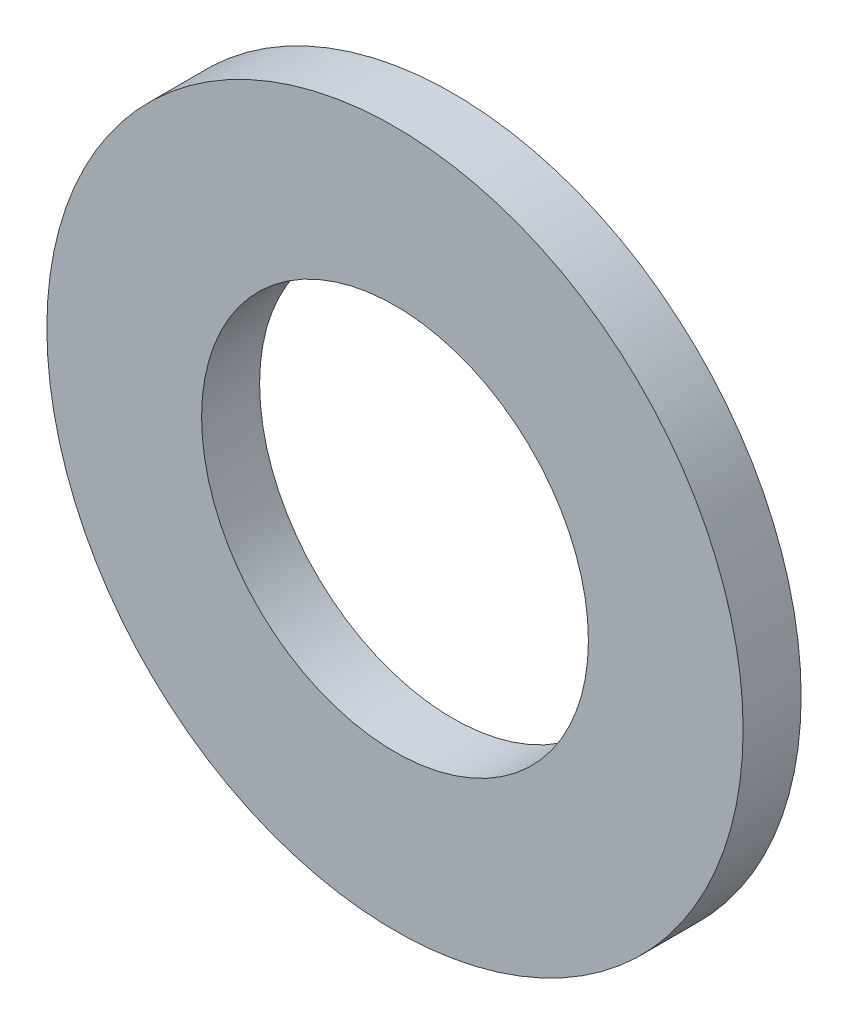
ISO-10303-21;
HEADER;
FILE_DESCRIPTION(('STEP AP214'),'2;1');
FILE_NAME('part.step','',(''),(''),'','','');
FILE_SCHEMA(('AUTOMOTIVE_DESIGN { 1 0 10303 214 1 1 1 1 }'));
ENDSEC;
DATA;
#1=APPLICATION_CONTEXT('core data for automotive mechanical design processes');
#2=APPLICATION_PROTOCOL_DEFINITION('international standard','automotive_design',2000,#1);
#3=PRODUCT_CONTEXT('',#1,'mechanical');
#4=PRODUCT('Part','Part','',(#3));
#5=PRODUCT_RELATED_PRODUCT_CATEGORY('part','',(#4));
#6=PRODUCT_DEFINITION_FORMATION('','',#4);
#7=PRODUCT_DEFINITION_CONTEXT('part definition',#1,'design');
#8=PRODUCT_DEFINITION('design','',#6,#7);
#9=PRODUCT_DEFINITION_SHAPE('','',#8);
#10=(LENGTH_UNIT() NAMED_UNIT(*) SI_UNIT(.MILLI.,.METRE.));
#11=(NAMED_UNIT(*) PLANE_ANGLE_UNIT() SI_UNIT($,.RADIAN.));
#12=(NAMED_UNIT(*) SI_UNIT($,.STERADIAN.) SOLID_ANGLE_UNIT());
#13=UNCERTAINTY_MEASURE_WITH_UNIT(LENGTH_MEASURE(1.E-05),#10,'distance_accuracy_value','');
#14=(GEOMETRIC_REPRESENTATION_CONTEXT(3) GLOBAL_UNCERTAINTY_ASSIGNED_CONTEXT((#13)) GLOBAL_UNIT_ASSIGNED_CONTEXT((#10,
#11,#12)) REPRESENTATION_CONTEXT('',''));
#15=CARTESIAN_POINT('',(0.,0.,0.));
#16=DIRECTION('',(0.,0.,1.));
#17=DIRECTION('',(1.,0.,0.));
#18=AXIS2_PLACEMENT_3D('',#15,#16,#17);
#19=CARTESIAN_POINT('',(0.,0.,0.749999999999999));
#20=DIRECTION('',(0.,0.,-1.));
#21=DIRECTION('',(1.,0.,0.));
#22=AXIS2_PLACEMENT_3D('',#19,#20,#21);
#23=CYLINDRICAL_SURFACE('',#22,9.);
#24=CARTESIAN_POINT('',(0.,0.,0.749999999999999));
#25=DIRECTION('',(0.,0.,1.));
#26=DIRECTION('',(1.,0.,0.));
#27=AXIS2_PLACEMENT_3D('',#24,#25,#26);
#28=CIRCLE('',#27,9.);
#29=CARTESIAN_POINT('',(9.,0.,0.749999999999999));
#30=VERTEX_POINT('',#29);
#31=EDGE_CURVE('E10',#30,#30,#28,.T.);
#32=ORIENTED_EDGE('',*,*,#31,.F.);
#33=EDGE_LOOP('',(#32));
#34=FACE_BOUND('',#33,.T.);
#35=CARTESIAN_POINT('',(0.,0.,-0.749999999999999));
#36=DIRECTION('',(0.,0.,1.));
#37=DIRECTION('',(1.,0.,0.));
#38=AXIS2_PLACEMENT_3D('',#35,#36,#37);
#39=CIRCLE('',#38,9.);
#40=CARTESIAN_POINT('',(9.,0.,-0.749999999999999));
#41=VERTEX_POINT('',#40);
#42=EDGE_CURVE('E49',#41,#41,#39,.T.);
#43=ORIENTED_EDGE('',*,*,#42,.T.);
#44=EDGE_LOOP('',(#43));
#45=FACE_BOUND('',#44,.T.);
#46=ADVANCED_FACE('F39',(#34,#45),#23,.T.);
#47=CARTESIAN_POINT('',(0.,0.,0.749999999999999));
#48=DIRECTION('',(0.,0.,-1.));
#49=DIRECTION('',(1.,0.,0.));
#50=AXIS2_PLACEMENT_3D('',#47,#48,#49);
#51=PLANE('',#50);
#52=CARTESIAN_POINT('',(0.,0.,0.749999999999999));
#53=DIRECTION('',(0.,0.,1.));
#54=DIRECTION('',(1.,0.,0.));
#55=AXIS2_PLACEMENT_3D('',#52,#53,#54);
#56=CIRCLE('',#55,5.);
#57=CARTESIAN_POINT('',(5.,0.,0.749999999999999));
#58=VERTEX_POINT('',#57);
#59=EDGE_CURVE('E45',#58,#58,#56,.T.);
#60=ORIENTED_EDGE('',*,*,#59,.F.);
#61=EDGE_LOOP('',(#60));
#62=FACE_BOUND('',#61,.T.);
#63=ORIENTED_EDGE('',*,*,#31,.T.);
#64=EDGE_LOOP('',(#63));
#65=FACE_BOUND('',#64,.T.);
#66=ADVANCED_FACE('F63',(#62,#65),#51,.F.);
#67=CARTESIAN_POINT('',(0.,0.,0.749999999999999));
#68=DIRECTION('',(0.,0.,-1.));
#69=DIRECTION('',(1.,0.,0.));
#70=AXIS2_PLACEMENT_3D('',#67,#68,#69);
#71=CYLINDRICAL_SURFACE('',#70,5.);
#72=ORIENTED_EDGE('',*,*,#59,.T.);
#73=EDGE_LOOP('',(#72));
#74=FACE_BOUND('',#73,.T.);
#75=CARTESIAN_POINT('',(0.,0.,-0.749999999999999));
#76=DIRECTION('',(0.,0.,1.));
#77=DIRECTION('',(1.,0.,0.));
#78=AXIS2_PLACEMENT_3D('',#75,#76,#77);
#79=CIRCLE('',#78,5.);
#80=CARTESIAN_POINT('',(5.,0.,-0.749999999999999));
#81=VERTEX_POINT('',#80);
#82=EDGE_CURVE('E53',#81,#81,#79,.T.);
#83=ORIENTED_EDGE('',*,*,#82,.F.);
#84=EDGE_LOOP('',(#83));
#85=FACE_BOUND('',#84,.T.);
#86=ADVANCED_FACE('F61',(#74,#85),#71,.F.);
#87=CARTESIAN_POINT('',(0.,0.,-0.749999999999999));
#88=DIRECTION('',(0.,0.,-1.));
#89=DIRECTION('',(1.,0.,0.));
#90=AXIS2_PLACEMENT_3D('',#87,#88,#89);
#91=PLANE('',#90);
#92=ORIENTED_EDGE('',*,*,#42,.F.);
#93=EDGE_LOOP('',(#92));
#94=FACE_BOUND('',#93,.T.);
#95=ORIENTED_EDGE('',*,*,#82,.T.);
#96=EDGE_LOOP('',(#95));
#97=FACE_BOUND('',#96,.T.);
#98=ADVANCED_FACE('F59',(#94,#97),#91,.T.);
#99=CLOSED_SHELL('',(#46,#66,#86,#98));
#100=MANIFOLD_SOLID_BREP('B2',#99);
#101=ADVANCED_BREP_SHAPE_REPRESENTATION('',(#18,#100),#14);
#102=SHAPE_DEFINITION_REPRESENTATION(#9,#101);
ENDSEC;
END-ISO-10303-21;
